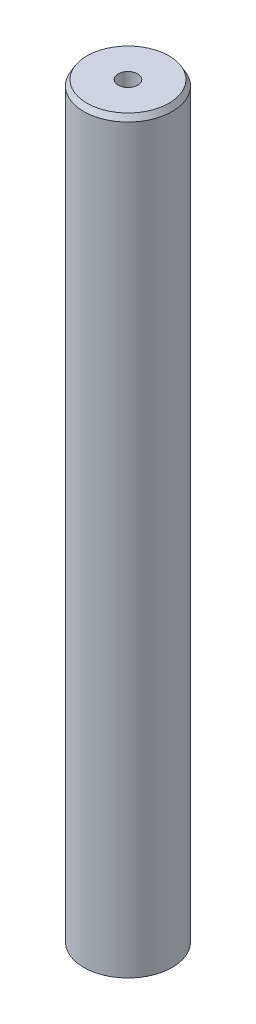
ISO-10303-21;
HEADER;
FILE_DESCRIPTION(('STEP AP214'),'2;1');
FILE_NAME('part.step','',(''),(''),'','','');
FILE_SCHEMA(('AUTOMOTIVE_DESIGN { 1 0 10303 214 1 1 1 1 }'));
ENDSEC;
DATA;
#1=APPLICATION_CONTEXT('core data for automotive mechanical design processes');
#2=APPLICATION_PROTOCOL_DEFINITION('international standard','automotive_design',2000,#1);
#3=PRODUCT_CONTEXT('',#1,'mechanical');
#4=PRODUCT('Part','Part','',(#3));
#5=PRODUCT_RELATED_PRODUCT_CATEGORY('part','',(#4));
#6=PRODUCT_DEFINITION_FORMATION('','',#4);
#7=PRODUCT_DEFINITION_CONTEXT('part definition',#1,'design');
#8=PRODUCT_DEFINITION('design','',#6,#7);
#9=PRODUCT_DEFINITION_SHAPE('','',#8);
#10=(LENGTH_UNIT() NAMED_UNIT(*) SI_UNIT(.MILLI.,.METRE.));
#11=(NAMED_UNIT(*) PLANE_ANGLE_UNIT() SI_UNIT($,.RADIAN.));
#12=(NAMED_UNIT(*) SI_UNIT($,.STERADIAN.) SOLID_ANGLE_UNIT());
#13=UNCERTAINTY_MEASURE_WITH_UNIT(LENGTH_MEASURE(1.E-05),#10,'distance_accuracy_value','');
#14=(GEOMETRIC_REPRESENTATION_CONTEXT(3) GLOBAL_UNCERTAINTY_ASSIGNED_CONTEXT((#13)) GLOBAL_UNIT_ASSIGNED_CONTEXT((#10,
#11,#12)) REPRESENTATION_CONTEXT('',''));
#15=CARTESIAN_POINT('',(0.,0.,0.));
#16=DIRECTION('',(0.,0.,1.));
#17=DIRECTION('',(1.,0.,0.));
#18=AXIS2_PLACEMENT_3D('',#15,#16,#17);
#19=CARTESIAN_POINT('',(0.,84.7232373492009,0.));
#20=DIRECTION('',(0.,-1.,0.));
#21=DIRECTION('',(0.,0.,-1.));
#22=AXIS2_PLACEMENT_3D('',#19,#20,#21);
#23=CYLINDRICAL_SURFACE('',#22,5.);
#24=CARTESIAN_POINT('',(0.,84.0938505487412,0.));
#25=DIRECTION('',(0.,1.,0.));
#26=DIRECTION('',(0.,0.,1.));
#27=AXIS2_PLACEMENT_3D('',#24,#25,#26);
#28=CIRCLE('',#27,5.);
#29=CARTESIAN_POINT('',(0.,84.0938505487412,5.));
#30=VERTEX_POINT('',#29);
#31=EDGE_CURVE('E50',#30,#30,#28,.F.);
#32=ORIENTED_EDGE('',*,*,#31,.T.);
#33=EDGE_LOOP('',(#32));
#34=FACE_BOUND('',#33,.T.);
#35=CARTESIAN_POINT('',(0.,0.363376638669824,0.));
#36=DIRECTION('',(0.,1.,0.));
#37=DIRECTION('',(0.,0.,1.));
#38=AXIS2_PLACEMENT_3D('',#35,#36,#37);
#39=CIRCLE('',#38,5.);
#40=CARTESIAN_POINT('',(0.,0.363376638669824,5.));
#41=VERTEX_POINT('',#40);
#42=EDGE_CURVE('E51',#41,#41,#39,.T.);
#43=ORIENTED_EDGE('',*,*,#42,.T.);
#44=EDGE_LOOP('',(#43));
#45=FACE_BOUND('',#44,.T.);
#46=ADVANCED_FACE('F39',(#34,#45),#23,.T.);
#47=CARTESIAN_POINT('',(0.,84.7232373492009,0.));
#48=DIRECTION('',(0.,1.,0.));
#49=DIRECTION('',(0.,0.,1.));
#50=AXIS2_PLACEMENT_3D('',#47,#48,#49);
#51=PLANE('',#50);
#52=CARTESIAN_POINT('',(0.,84.7232373492009,0.));
#53=DIRECTION('',(0.,1.,0.));
#54=DIRECTION('',(0.,0.,1.));
#55=AXIS2_PLACEMENT_3D('',#52,#53,#54);
#56=CIRCLE('',#55,4.63662336133017);
#57=CARTESIAN_POINT('',(0.,84.7232373492009,4.63662336133017));
#58=VERTEX_POINT('',#57);
#59=EDGE_CURVE('E54',#58,#58,#56,.T.);
#60=ORIENTED_EDGE('',*,*,#59,.T.);
#61=EDGE_LOOP('',(#60));
#62=FACE_BOUND('',#61,.T.);
#63=CARTESIAN_POINT('',(0.,84.7232373492009,0.));
#64=DIRECTION('',(0.,1.,0.));
#65=DIRECTION('',(0.,0.,1.));
#66=AXIS2_PLACEMENT_3D('',#63,#64,#65);
#67=CIRCLE('',#66,1.10636991503706);
#68=CARTESIAN_POINT('',(0.,84.7232373492009,1.10636991503706));
#69=VERTEX_POINT('',#68);
#70=EDGE_CURVE('E58',#69,#69,#67,.T.);
#71=ORIENTED_EDGE('',*,*,#70,.F.);
#72=EDGE_LOOP('',(#71));
#73=FACE_BOUND('',#72,.T.);
#74=ADVANCED_FACE('F69',(#62,#73),#51,.T.);
#75=CARTESIAN_POINT('',(0.,0.,0.));
#76=DIRECTION('',(0.,1.,0.));
#77=DIRECTION('',(0.,0.,1.));
#78=AXIS2_PLACEMENT_3D('',#75,#76,#77);
#79=PLANE('',#78);
#80=CARTESIAN_POINT('',(0.,0.,0.));
#81=DIRECTION('',(0.,1.,0.));
#82=DIRECTION('',(0.,0.,1.));
#83=AXIS2_PLACEMENT_3D('',#80,#81,#82);
#84=CIRCLE('',#83,4.37061319954026);
#85=CARTESIAN_POINT('',(0.,0.,4.37061319954026));
#86=VERTEX_POINT('',#85);
#87=EDGE_CURVE('E10',#86,#86,#84,.F.);
#88=ORIENTED_EDGE('',*,*,#87,.T.);
#89=EDGE_LOOP('',(#88));
#90=FACE_BOUND('',#89,.T.);
#91=CARTESIAN_POINT('',(0.,0.,0.));
#92=DIRECTION('',(0.,1.,0.));
#93=DIRECTION('',(0.,0.,1.));
#94=AXIS2_PLACEMENT_3D('',#91,#92,#93);
#95=CIRCLE('',#94,1.10636991503706);
#96=CARTESIAN_POINT('',(0.,0.,1.10636991503706));
#97=VERTEX_POINT('',#96);
#98=EDGE_CURVE('E63',#97,#97,#95,.T.);
#99=ORIENTED_EDGE('',*,*,#98,.T.);
#100=EDGE_LOOP('',(#99));
#101=FACE_BOUND('',#100,.T.);
#102=ADVANCED_FACE('F75',(#90,#101),#79,.F.);
#103=CARTESIAN_POINT('',(0.,84.7232373492009,0.));
#104=DIRECTION('',(0.,-1.,0.));
#105=DIRECTION('',(0.,0.,-1.));
#106=AXIS2_PLACEMENT_3D('',#103,#104,#105);
#107=CYLINDRICAL_SURFACE('',#106,1.10636991503706);
#108=ORIENTED_EDGE('',*,*,#70,.T.);
#109=EDGE_LOOP('',(#108));
#110=FACE_BOUND('',#109,.T.);
#111=ORIENTED_EDGE('',*,*,#98,.F.);
#112=EDGE_LOOP('',(#111));
#113=FACE_BOUND('',#112,.T.);
#114=ADVANCED_FACE('F70',(#110,#113),#107,.F.);
#115=CARTESIAN_POINT('',(0.,84.7232373492009,0.));
#116=DIRECTION('',(0.,-1.,0.));
#117=DIRECTION('',(0.,0.,-1.));
#118=AXIS2_PLACEMENT_3D('',#115,#116,#117);
#119=CONICAL_SURFACE('',#118,4.63662336133017,0.523598775598299);
#120=ORIENTED_EDGE('',*,*,#31,.F.);
#121=EDGE_LOOP('',(#120));
#122=FACE_BOUND('',#121,.T.);
#123=ORIENTED_EDGE('',*,*,#59,.F.);
#124=EDGE_LOOP('',(#123));
#125=FACE_BOUND('',#124,.T.);
#126=ADVANCED_FACE('F81',(#122,#125),#119,.T.);
#127=CARTESIAN_POINT('',(0.,0.363376638669824,0.));
#128=DIRECTION('',(0.,1.,0.));
#129=DIRECTION('',(0.,0.,1.));
#130=AXIS2_PLACEMENT_3D('',#127,#128,#129);
#131=CONICAL_SURFACE('',#130,5.,1.04719755119661);
#132=ORIENTED_EDGE('',*,*,#87,.F.);
#133=EDGE_LOOP('',(#132));
#134=FACE_BOUND('',#133,.T.);
#135=ORIENTED_EDGE('',*,*,#42,.F.);
#136=EDGE_LOOP('',(#135));
#137=FACE_BOUND('',#136,.T.);
#138=ADVANCED_FACE('F45',(#134,#137),#131,.T.);
#139=CLOSED_SHELL('',(#46,#74,#102,#114,#126,#138));
#140=MANIFOLD_SOLID_BREP('B2',#139);
#141=ADVANCED_BREP_SHAPE_REPRESENTATION('',(#18,#140),#14);
#142=SHAPE_DEFINITION_REPRESENTATION(#9,#141);
ENDSEC;
END-ISO-10303-21;
